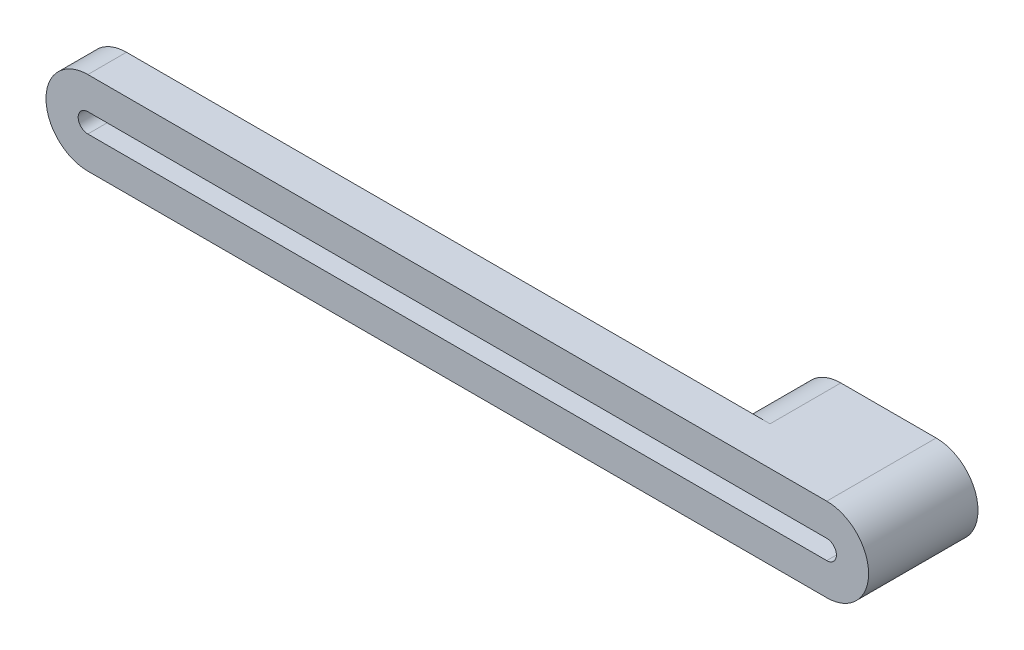
ISO-10303-21;
HEADER;
FILE_DESCRIPTION(('STEP AP214'),'2;1');
FILE_NAME('part.step','',(''),(''),'','','');
FILE_SCHEMA(('AUTOMOTIVE_DESIGN { 1 0 10303 214 1 1 1 1 }'));
ENDSEC;
DATA;
#1=APPLICATION_CONTEXT('core data for automotive mechanical design processes');
#2=APPLICATION_PROTOCOL_DEFINITION('international standard','automotive_design',2000,#1);
#3=PRODUCT_CONTEXT('',#1,'mechanical');
#4=PRODUCT('Part','Part','',(#3));
#5=PRODUCT_RELATED_PRODUCT_CATEGORY('part','',(#4));
#6=PRODUCT_DEFINITION_FORMATION('','',#4);
#7=PRODUCT_DEFINITION_CONTEXT('part definition',#1,'design');
#8=PRODUCT_DEFINITION('design','',#6,#7);
#9=PRODUCT_DEFINITION_SHAPE('','',#8);
#10=(LENGTH_UNIT() NAMED_UNIT(*) SI_UNIT(.MILLI.,.METRE.));
#11=(NAMED_UNIT(*) PLANE_ANGLE_UNIT() SI_UNIT($,.RADIAN.));
#12=(NAMED_UNIT(*) SI_UNIT($,.STERADIAN.) SOLID_ANGLE_UNIT());
#13=UNCERTAINTY_MEASURE_WITH_UNIT(LENGTH_MEASURE(1.E-05),#10,'distance_accuracy_value','');
#14=(GEOMETRIC_REPRESENTATION_CONTEXT(3) GLOBAL_UNCERTAINTY_ASSIGNED_CONTEXT((#13)) GLOBAL_UNIT_ASSIGNED_CONTEXT((#10,
#11,#12)) REPRESENTATION_CONTEXT('',''));
#15=CARTESIAN_POINT('',(0.,0.,0.));
#16=DIRECTION('',(0.,0.,1.));
#17=DIRECTION('',(1.,0.,0.));
#18=AXIS2_PLACEMENT_3D('',#15,#16,#17);
#19=CARTESIAN_POINT('',(-68.8658238926702,16.2918173638099,11.));
#20=DIRECTION('',(0.,0.,-1.));
#21=DIRECTION('',(-1.,0.,0.));
#22=AXIS2_PLACEMENT_3D('',#19,#20,#21);
#23=PLANE('',#22);
#24=CARTESIAN_POINT('',(-83.6756841706861,16.2918173638099,11.));
#25=DIRECTION('',(0.,0.,1.));
#26=DIRECTION('',(1.,0.,0.));
#27=AXIS2_PLACEMENT_3D('',#24,#25,#26);
#28=CIRCLE('',#27,6.5);
#29=CARTESIAN_POINT('',(-90.0002394910229,17.7918173638099,11.));
#30=VERTEX_POINT('',#29);
#31=CARTESIAN_POINT('',(-90.0002394910229,14.7918173638099,11.));
#32=VERTEX_POINT('',#31);
#33=EDGE_CURVE('E226',#30,#32,#28,.T.);
#34=ORIENTED_EDGE('',*,*,#33,.T.);
#35=DIRECTION('',(1.,0.,0.));
#36=VECTOR('',#35,1.);
#37=CARTESIAN_POINT('',(-83.6756841706861,14.7918173638099,11.));
#38=LINE('',#37,#36);
#39=CARTESIAN_POINT('',(-83.6756841706861,14.7918173638099,11.));
#40=VERTEX_POINT('',#39);
#41=EDGE_CURVE('E13',#32,#40,#38,.T.);
#42=ORIENTED_EDGE('',*,*,#41,.T.);
#43=CARTESIAN_POINT('',(-83.6756841706861,16.2918173638099,11.));
#44=DIRECTION('',(0.,0.,1.));
#45=DIRECTION('',(1.,0.,0.));
#46=AXIS2_PLACEMENT_3D('',#43,#44,#45);
#47=CIRCLE('',#46,1.50000000000001);
#48=CARTESIAN_POINT('',(-83.6756841706861,17.7918173638099,11.));
#49=VERTEX_POINT('',#48);
#50=EDGE_CURVE('E201',#49,#40,#47,.T.);
#51=ORIENTED_EDGE('',*,*,#50,.F.);
#52=DIRECTION('',(-1.,0.,0.));
#53=VECTOR('',#52,1.);
#54=CARTESIAN_POINT('',(-183.675684170686,17.7918173638099,11.));
#55=LINE('',#54,#53);
#56=EDGE_CURVE('E55',#49,#30,#55,.T.);
#57=ORIENTED_EDGE('',*,*,#56,.T.);
#58=EDGE_LOOP('',(#34,#42,#51,#57));
#59=FACE_BOUND('',#58,.T.);
#60=ADVANCED_FACE('F46',(#59),#23,.F.);
#61=CARTESIAN_POINT('',(-68.8658238926702,16.2918173638099,0.));
#62=DIRECTION('',(0.,0.,-1.));
#63=DIRECTION('',(-1.,0.,0.));
#64=AXIS2_PLACEMENT_3D('',#61,#62,#63);
#65=PLANE('',#64);
#66=CARTESIAN_POINT('',(-68.8658238926702,16.2918173638099,0.));
#67=DIRECTION('',(0.,0.,1.));
#68=DIRECTION('',(-1.,0.,0.));
#69=AXIS2_PLACEMENT_3D('',#66,#67,#68);
#70=CIRCLE('',#69,6.5);
#71=CARTESIAN_POINT('',(-68.8658238926702,9.79181736380994,0.));
#72=VERTEX_POINT('',#71);
#73=CARTESIAN_POINT('',(-68.8658238926702,22.7918173638099,0.));
#74=VERTEX_POINT('',#73);
#75=EDGE_CURVE('E222',#72,#74,#70,.T.);
#76=ORIENTED_EDGE('',*,*,#75,.F.);
#77=DIRECTION('',(1.,0.,0.));
#78=VECTOR('',#77,1.);
#79=CARTESIAN_POINT('',(-68.8658238926702,9.79181736380994,0.));
#80=LINE('',#79,#78);
#81=CARTESIAN_POINT('',(-83.6756841706861,9.79181736380992,0.));
#82=VERTEX_POINT('',#81);
#83=EDGE_CURVE('E234',#82,#72,#80,.T.);
#84=ORIENTED_EDGE('',*,*,#83,.F.);
#85=CARTESIAN_POINT('',(-83.6756841706861,16.2918173638099,0.));
#86=DIRECTION('',(0.,0.,1.));
#87=DIRECTION('',(1.,0.,0.));
#88=AXIS2_PLACEMENT_3D('',#85,#86,#87);
#89=CIRCLE('',#88,6.5);
#90=CARTESIAN_POINT('',(-83.6756841706861,22.7918173638099,0.));
#91=VERTEX_POINT('',#90);
#92=EDGE_CURVE('E232',#91,#82,#89,.T.);
#93=ORIENTED_EDGE('',*,*,#92,.F.);
#94=DIRECTION('',(-1.,0.,0.));
#95=VECTOR('',#94,1.);
#96=CARTESIAN_POINT('',(-68.8658238926702,22.7918173638099,0.));
#97=LINE('',#96,#95);
#98=EDGE_CURVE('E230',#74,#91,#97,.T.);
#99=ORIENTED_EDGE('',*,*,#98,.F.);
#100=EDGE_LOOP('',(#76,#84,#93,#99));
#101=FACE_BOUND('',#100,.T.);
#102=DIRECTION('',(1.,0.,0.));
#103=VECTOR('',#102,1.);
#104=CARTESIAN_POINT('',(-68.8658238926702,14.7918173638099,0.));
#105=LINE('',#104,#103);
#106=CARTESIAN_POINT('',(-83.6756841706861,14.7918173638099,0.));
#107=VERTEX_POINT('',#106);
#108=CARTESIAN_POINT('',(-68.8658238926702,14.7918173638099,0.));
#109=VERTEX_POINT('',#108);
#110=EDGE_CURVE('E205',#107,#109,#105,.T.);
#111=ORIENTED_EDGE('',*,*,#110,.T.);
#112=CARTESIAN_POINT('',(-68.8658238926702,16.2918173638099,0.));
#113=DIRECTION('',(0.,0.,1.));
#114=DIRECTION('',(-1.,0.,0.));
#115=AXIS2_PLACEMENT_3D('',#112,#113,#114);
#116=CIRCLE('',#115,1.5);
#117=CARTESIAN_POINT('',(-68.8658238926702,17.7918173638099,0.));
#118=VERTEX_POINT('',#117);
#119=EDGE_CURVE('E72',#109,#118,#116,.T.);
#120=ORIENTED_EDGE('',*,*,#119,.T.);
#121=DIRECTION('',(-1.,0.,0.));
#122=VECTOR('',#121,1.);
#123=CARTESIAN_POINT('',(-68.8658238926702,17.7918173638099,0.));
#124=LINE('',#123,#122);
#125=CARTESIAN_POINT('',(-83.6756841706861,17.7918173638099,0.));
#126=VERTEX_POINT('',#125);
#127=EDGE_CURVE('E207',#118,#126,#124,.T.);
#128=ORIENTED_EDGE('',*,*,#127,.T.);
#129=CARTESIAN_POINT('',(-83.6756841706861,16.2918173638099,0.));
#130=DIRECTION('',(0.,0.,1.));
#131=DIRECTION('',(1.,0.,0.));
#132=AXIS2_PLACEMENT_3D('',#129,#130,#131);
#133=CIRCLE('',#132,1.50000000000001);
#134=EDGE_CURVE('E210',#126,#107,#133,.T.);
#135=ORIENTED_EDGE('',*,*,#134,.T.);
#136=EDGE_LOOP('',(#111,#120,#128,#135));
#137=FACE_BOUND('',#136,.T.);
#138=ADVANCED_FACE('F267',(#101,#137),#65,.T.);
#139=CARTESIAN_POINT('',(-68.8658238926702,16.2918173638099,11.));
#140=DIRECTION('',(0.,0.,-1.));
#141=DIRECTION('',(-1.,0.,0.));
#142=AXIS2_PLACEMENT_3D('',#139,#140,#141);
#143=CYLINDRICAL_SURFACE('',#142,6.5);
#144=ORIENTED_EDGE('',*,*,#75,.T.);
#145=DIRECTION('',(0.,0.,-1.));
#146=VECTOR('',#145,1.);
#147=CARTESIAN_POINT('',(-68.8658238926702,22.7918173638099,11.));
#148=LINE('',#147,#146);
#149=CARTESIAN_POINT('',(-68.8658238926702,22.7918173638099,17.));
#150=VERTEX_POINT('',#149);
#151=EDGE_CURVE('E50',#150,#74,#148,.T.);
#152=ORIENTED_EDGE('',*,*,#151,.F.);
#153=CARTESIAN_POINT('',(-68.8658238926702,16.2918173638099,17.));
#154=DIRECTION('',(0.,0.,1.));
#155=DIRECTION('',(-1.,0.,0.));
#156=AXIS2_PLACEMENT_3D('',#153,#154,#155);
#157=CIRCLE('',#156,6.5);
#158=CARTESIAN_POINT('',(-68.8658238926701,9.79181736380994,17.));
#159=VERTEX_POINT('',#158);
#160=EDGE_CURVE('E184',#159,#150,#157,.T.);
#161=ORIENTED_EDGE('',*,*,#160,.F.);
#162=DIRECTION('',(0.,0.,-1.));
#163=VECTOR('',#162,1.);
#164=CARTESIAN_POINT('',(-68.8658238926702,9.79181736380994,11.));
#165=LINE('',#164,#163);
#166=EDGE_CURVE('E225',#159,#72,#165,.T.);
#167=ORIENTED_EDGE('',*,*,#166,.T.);
#168=EDGE_LOOP('',(#144,#152,#161,#167));
#169=FACE_BOUND('',#168,.T.);
#170=ADVANCED_FACE('F48',(#169),#143,.T.);
#171=CARTESIAN_POINT('',(-68.8658238926702,22.7918173638099,11.));
#172=DIRECTION('',(0.,-1.,0.));
#173=DIRECTION('',(0.,0.,-1.));
#174=AXIS2_PLACEMENT_3D('',#171,#172,#173);
#175=PLANE('',#174);
#176=ORIENTED_EDGE('',*,*,#98,.T.);
#177=DIRECTION('',(0.,0.,-1.));
#178=VECTOR('',#177,1.);
#179=CARTESIAN_POINT('',(-83.6756841706861,22.7918173638099,11.));
#180=LINE('',#179,#178);
#181=CARTESIAN_POINT('',(-83.6756841706861,22.7918173638099,11.));
#182=VERTEX_POINT('',#181);
#183=EDGE_CURVE('E240',#182,#91,#180,.T.);
#184=ORIENTED_EDGE('',*,*,#183,.F.);
#185=DIRECTION('',(-1.,0.,0.));
#186=VECTOR('',#185,1.);
#187=CARTESIAN_POINT('',(-183.675684170686,22.7918173638099,11.));
#188=LINE('',#187,#186);
#189=CARTESIAN_POINT('',(-183.675684170686,22.7918173638099,11.));
#190=VERTEX_POINT('',#189);
#191=EDGE_CURVE('E181',#182,#190,#188,.T.);
#192=ORIENTED_EDGE('',*,*,#191,.T.);
#193=DIRECTION('',(0.,0.,-1.));
#194=VECTOR('',#193,1.);
#195=CARTESIAN_POINT('',(-183.675684170686,22.7918173638099,17.));
#196=LINE('',#195,#194);
#197=CARTESIAN_POINT('',(-183.675684170686,22.7918173638099,17.));
#198=VERTEX_POINT('',#197);
#199=EDGE_CURVE('E189',#198,#190,#196,.T.);
#200=ORIENTED_EDGE('',*,*,#199,.F.);
#201=DIRECTION('',(-1.,0.,0.));
#202=VECTOR('',#201,1.);
#203=CARTESIAN_POINT('',(-83.6756841706861,22.7918173638099,17.));
#204=LINE('',#203,#202);
#205=EDGE_CURVE('E187',#150,#198,#204,.T.);
#206=ORIENTED_EDGE('',*,*,#205,.F.);
#207=ORIENTED_EDGE('',*,*,#151,.T.);
#208=EDGE_LOOP('',(#176,#184,#192,#200,#206,#207));
#209=FACE_BOUND('',#208,.T.);
#210=ADVANCED_FACE('F273',(#209),#175,.F.);
#211=CARTESIAN_POINT('',(-83.6756841706861,16.2918173638099,11.));
#212=DIRECTION('',(0.,0.,-1.));
#213=DIRECTION('',(-1.,0.,0.));
#214=AXIS2_PLACEMENT_3D('',#211,#212,#213);
#215=CYLINDRICAL_SURFACE('',#214,6.5);
#216=ORIENTED_EDGE('',*,*,#92,.T.);
#217=DIRECTION('',(0.,0.,-1.));
#218=VECTOR('',#217,1.);
#219=CARTESIAN_POINT('',(-83.6756841706861,9.79181736380992,11.));
#220=LINE('',#219,#218);
#221=CARTESIAN_POINT('',(-83.6756841706861,9.79181736380993,11.));
#222=VERTEX_POINT('',#221);
#223=EDGE_CURVE('E238',#222,#82,#220,.T.);
#224=ORIENTED_EDGE('',*,*,#223,.F.);
#225=EDGE_CURVE('E227',#32,#222,#28,.T.);
#226=ORIENTED_EDGE('',*,*,#225,.F.);
#227=ORIENTED_EDGE('',*,*,#33,.F.);
#228=EDGE_CURVE('E223',#182,#30,#28,.T.);
#229=ORIENTED_EDGE('',*,*,#228,.F.);
#230=ORIENTED_EDGE('',*,*,#183,.T.);
#231=EDGE_LOOP('',(#216,#224,#226,#227,#229,#230));
#232=FACE_BOUND('',#231,.T.);
#233=ADVANCED_FACE('F256',(#232),#215,.T.);
#234=CARTESIAN_POINT('',(-68.8658238926702,9.79181736380994,11.));
#235=DIRECTION('',(0.,1.,0.));
#236=DIRECTION('',(-1.,0.,0.));
#237=AXIS2_PLACEMENT_3D('',#234,#235,#236);
#238=PLANE('',#237);
#239=ORIENTED_EDGE('',*,*,#83,.T.);
#240=ORIENTED_EDGE('',*,*,#166,.F.);
#241=DIRECTION('',(1.,0.,0.));
#242=VECTOR('',#241,1.);
#243=CARTESIAN_POINT('',(-183.675684170686,9.79181736380991,17.));
#244=LINE('',#243,#242);
#245=CARTESIAN_POINT('',(-183.675684170686,9.79181736380991,17.));
#246=VERTEX_POINT('',#245);
#247=EDGE_CURVE('E180',#246,#159,#244,.T.);
#248=ORIENTED_EDGE('',*,*,#247,.F.);
#249=DIRECTION('',(0.,0.,-1.));
#250=VECTOR('',#249,1.);
#251=CARTESIAN_POINT('',(-183.675684170686,9.79181736380991,17.));
#252=LINE('',#251,#250);
#253=CARTESIAN_POINT('',(-183.675684170686,9.79181736380991,11.));
#254=VERTEX_POINT('',#253);
#255=EDGE_CURVE('E198',#246,#254,#252,.T.);
#256=ORIENTED_EDGE('',*,*,#255,.T.);
#257=DIRECTION('',(1.,0.,0.));
#258=VECTOR('',#257,1.);
#259=CARTESIAN_POINT('',(-83.6756841706861,9.79181736380992,11.));
#260=LINE('',#259,#258);
#261=EDGE_CURVE('E192',#254,#222,#260,.T.);
#262=ORIENTED_EDGE('',*,*,#261,.T.);
#263=ORIENTED_EDGE('',*,*,#223,.T.);
#264=EDGE_LOOP('',(#239,#240,#248,#256,#262,#263));
#265=FACE_BOUND('',#264,.T.);
#266=ADVANCED_FACE('F262',(#265),#238,.F.);
#267=CARTESIAN_POINT('',(-68.8658238926702,16.2918173638099,11.));
#268=DIRECTION('',(0.,0.,-1.));
#269=DIRECTION('',(-1.,0.,0.));
#270=AXIS2_PLACEMENT_3D('',#267,#268,#269);
#271=CYLINDRICAL_SURFACE('',#270,1.5);
#272=ORIENTED_EDGE('',*,*,#119,.F.);
#273=DIRECTION('',(0.,0.,-1.));
#274=VECTOR('',#273,1.);
#275=CARTESIAN_POINT('',(-68.8658238926702,14.7918173638099,11.));
#276=LINE('',#275,#274);
#277=CARTESIAN_POINT('',(-68.8658238926702,14.7918173638099,17.));
#278=VERTEX_POINT('',#277);
#279=EDGE_CURVE('E204',#278,#109,#276,.T.);
#280=ORIENTED_EDGE('',*,*,#279,.F.);
#281=CARTESIAN_POINT('',(-68.8658238926702,16.2918173638099,17.));
#282=DIRECTION('',(0.,0.,1.));
#283=DIRECTION('',(-1.,0.,0.));
#284=AXIS2_PLACEMENT_3D('',#281,#282,#283);
#285=CIRCLE('',#284,1.49999999999998);
#286=CARTESIAN_POINT('',(-68.8658238926702,17.7918173638099,17.));
#287=VERTEX_POINT('',#286);
#288=EDGE_CURVE('E167',#278,#287,#285,.T.);
#289=ORIENTED_EDGE('',*,*,#288,.T.);
#290=DIRECTION('',(0.,0.,-1.));
#291=VECTOR('',#290,1.);
#292=CARTESIAN_POINT('',(-68.8658238926702,17.7918173638099,11.));
#293=LINE('',#292,#291);
#294=EDGE_CURVE('E220',#287,#118,#293,.T.);
#295=ORIENTED_EDGE('',*,*,#294,.T.);
#296=EDGE_LOOP('',(#272,#280,#289,#295));
#297=FACE_BOUND('',#296,.T.);
#298=ADVANCED_FACE('F278',(#297),#271,.F.);
#299=CARTESIAN_POINT('',(-68.8658238926702,17.7918173638099,11.));
#300=DIRECTION('',(0.,-1.,0.));
#301=DIRECTION('',(0.,0.,-1.));
#302=AXIS2_PLACEMENT_3D('',#299,#300,#301);
#303=PLANE('',#302);
#304=ORIENTED_EDGE('',*,*,#127,.F.);
#305=ORIENTED_EDGE('',*,*,#294,.F.);
#306=DIRECTION('',(-1.,0.,0.));
#307=VECTOR('',#306,1.);
#308=CARTESIAN_POINT('',(-83.6756841706861,17.7918173638099,17.));
#309=LINE('',#308,#307);
#310=CARTESIAN_POINT('',(-183.675684170686,17.7918173638099,17.));
#311=VERTEX_POINT('',#310);
#312=EDGE_CURVE('E169',#287,#311,#309,.T.);
#313=ORIENTED_EDGE('',*,*,#312,.T.);
#314=DIRECTION('',(0.,0.,-1.));
#315=VECTOR('',#314,1.);
#316=CARTESIAN_POINT('',(-183.675684170686,17.7918173638099,17.));
#317=LINE('',#316,#315);
#318=CARTESIAN_POINT('',(-183.675684170686,17.7918173638099,11.));
#319=VERTEX_POINT('',#318);
#320=EDGE_CURVE('E151',#311,#319,#317,.T.);
#321=ORIENTED_EDGE('',*,*,#320,.T.);
#322=EDGE_CURVE('E64',#30,#319,#55,.T.);
#323=ORIENTED_EDGE('',*,*,#322,.F.);
#324=ORIENTED_EDGE('',*,*,#56,.F.);
#325=DIRECTION('',(0.,0.,-1.));
#326=VECTOR('',#325,1.);
#327=CARTESIAN_POINT('',(-83.6756841706861,17.7918173638099,11.));
#328=LINE('',#327,#326);
#329=EDGE_CURVE('E218',#49,#126,#328,.T.);
#330=ORIENTED_EDGE('',*,*,#329,.T.);
#331=EDGE_LOOP('',(#304,#305,#313,#321,#323,#324,#330));
#332=FACE_BOUND('',#331,.T.);
#333=ADVANCED_FACE('F277',(#332),#303,.T.);
#334=CARTESIAN_POINT('',(-83.6756841706861,16.2918173638099,11.));
#335=DIRECTION('',(0.,0.,-1.));
#336=DIRECTION('',(-1.,0.,0.));
#337=AXIS2_PLACEMENT_3D('',#334,#335,#336);
#338=CYLINDRICAL_SURFACE('',#337,1.50000000000001);
#339=ORIENTED_EDGE('',*,*,#134,.F.);
#340=ORIENTED_EDGE('',*,*,#329,.F.);
#341=ORIENTED_EDGE('',*,*,#50,.T.);
#342=DIRECTION('',(0.,0.,-1.));
#343=VECTOR('',#342,1.);
#344=CARTESIAN_POINT('',(-83.6756841706861,14.7918173638099,11.));
#345=LINE('',#344,#343);
#346=EDGE_CURVE('E216',#40,#107,#345,.T.);
#347=ORIENTED_EDGE('',*,*,#346,.T.);
#348=EDGE_LOOP('',(#339,#340,#341,#347));
#349=FACE_BOUND('',#348,.T.);
#350=ADVANCED_FACE('F282',(#349),#338,.F.);
#351=CARTESIAN_POINT('',(-68.8658238926702,14.7918173638099,11.));
#352=DIRECTION('',(0.,1.,0.));
#353=DIRECTION('',(-1.,0.,0.));
#354=AXIS2_PLACEMENT_3D('',#351,#352,#353);
#355=PLANE('',#354);
#356=ORIENTED_EDGE('',*,*,#110,.F.);
#357=ORIENTED_EDGE('',*,*,#346,.F.);
#358=ORIENTED_EDGE('',*,*,#41,.F.);
#359=CARTESIAN_POINT('',(-183.675684170686,14.7918173638099,11.));
#360=VERTEX_POINT('',#359);
#361=EDGE_CURVE('E57',#360,#32,#38,.T.);
#362=ORIENTED_EDGE('',*,*,#361,.F.);
#363=DIRECTION('',(0.,0.,-1.));
#364=VECTOR('',#363,1.);
#365=CARTESIAN_POINT('',(-183.675684170686,14.7918173638099,17.));
#366=LINE('',#365,#364);
#367=CARTESIAN_POINT('',(-183.675684170686,14.7918173638099,17.));
#368=VERTEX_POINT('',#367);
#369=EDGE_CURVE('E149',#368,#360,#366,.T.);
#370=ORIENTED_EDGE('',*,*,#369,.F.);
#371=DIRECTION('',(1.,0.,0.));
#372=VECTOR('',#371,1.);
#373=CARTESIAN_POINT('',(-183.675684170686,14.7918173638099,17.));
#374=LINE('',#373,#372);
#375=EDGE_CURVE('E155',#368,#278,#374,.T.);
#376=ORIENTED_EDGE('',*,*,#375,.T.);
#377=ORIENTED_EDGE('',*,*,#279,.T.);
#378=EDGE_LOOP('',(#356,#357,#358,#362,#370,#376,#377));
#379=FACE_BOUND('',#378,.T.);
#380=ADVANCED_FACE('F160',(#379),#355,.T.);
#381=CARTESIAN_POINT('',(-183.675684170686,16.2918173638099,11.));
#382=DIRECTION('',(0.,0.,1.));
#383=DIRECTION('',(1.,0.,0.));
#384=AXIS2_PLACEMENT_3D('',#381,#382,#383);
#385=PLANE('',#384);
#386=ORIENTED_EDGE('',*,*,#191,.F.);
#387=ORIENTED_EDGE('',*,*,#228,.T.);
#388=ORIENTED_EDGE('',*,*,#322,.T.);
#389=CARTESIAN_POINT('',(-183.675684170686,16.2918173638099,11.));
#390=DIRECTION('',(0.,0.,1.));
#391=DIRECTION('',(1.,0.,0.));
#392=AXIS2_PLACEMENT_3D('',#389,#390,#391);
#393=CIRCLE('',#392,1.5);
#394=EDGE_CURVE('E173',#319,#360,#393,.T.);
#395=ORIENTED_EDGE('',*,*,#394,.T.);
#396=ORIENTED_EDGE('',*,*,#361,.T.);
#397=ORIENTED_EDGE('',*,*,#225,.T.);
#398=ORIENTED_EDGE('',*,*,#261,.F.);
#399=CARTESIAN_POINT('',(-183.675684170686,16.2918173638099,11.));
#400=DIRECTION('',(0.,0.,1.));
#401=DIRECTION('',(1.,0.,0.));
#402=AXIS2_PLACEMENT_3D('',#399,#400,#401);
#403=CIRCLE('',#402,6.5);
#404=EDGE_CURVE('E163',#190,#254,#403,.T.);
#405=ORIENTED_EDGE('',*,*,#404,.F.);
#406=EDGE_LOOP('',(#386,#387,#388,#395,#396,#397,#398,#405));
#407=FACE_BOUND('',#406,.T.);
#408=ADVANCED_FACE('F259',(#407),#385,.F.);
#409=CARTESIAN_POINT('',(-183.675684170686,16.2918173638099,17.));
#410=DIRECTION('',(0.,0.,1.));
#411=DIRECTION('',(1.,0.,0.));
#412=AXIS2_PLACEMENT_3D('',#409,#410,#411);
#413=PLANE('',#412);
#414=CARTESIAN_POINT('',(-183.675684170686,16.2918173638099,17.));
#415=DIRECTION('',(0.,0.,1.));
#416=DIRECTION('',(1.,0.,0.));
#417=AXIS2_PLACEMENT_3D('',#414,#415,#416);
#418=CIRCLE('',#417,6.5);
#419=EDGE_CURVE('E177',#198,#246,#418,.T.);
#420=ORIENTED_EDGE('',*,*,#419,.T.);
#421=ORIENTED_EDGE('',*,*,#247,.T.);
#422=ORIENTED_EDGE('',*,*,#160,.T.);
#423=ORIENTED_EDGE('',*,*,#205,.T.);
#424=EDGE_LOOP('',(#420,#421,#422,#423));
#425=FACE_BOUND('',#424,.T.);
#426=ORIENTED_EDGE('',*,*,#375,.F.);
#427=CARTESIAN_POINT('',(-183.675684170686,16.2918173638099,17.));
#428=DIRECTION('',(0.,0.,1.));
#429=DIRECTION('',(1.,0.,0.));
#430=AXIS2_PLACEMENT_3D('',#427,#428,#429);
#431=CIRCLE('',#430,1.5);
#432=EDGE_CURVE('E145',#311,#368,#431,.T.);
#433=ORIENTED_EDGE('',*,*,#432,.F.);
#434=ORIENTED_EDGE('',*,*,#312,.F.);
#435=ORIENTED_EDGE('',*,*,#288,.F.);
#436=EDGE_LOOP('',(#426,#433,#434,#435));
#437=FACE_BOUND('',#436,.T.);
#438=ADVANCED_FACE('F165',(#425,#437),#413,.T.);
#439=CARTESIAN_POINT('',(-183.675684170686,16.2918173638099,17.));
#440=DIRECTION('',(0.,0.,-1.));
#441=DIRECTION('',(-1.,0.,0.));
#442=AXIS2_PLACEMENT_3D('',#439,#440,#441);
#443=CYLINDRICAL_SURFACE('',#442,6.5);
#444=ORIENTED_EDGE('',*,*,#404,.T.);
#445=ORIENTED_EDGE('',*,*,#255,.F.);
#446=ORIENTED_EDGE('',*,*,#419,.F.);
#447=ORIENTED_EDGE('',*,*,#199,.T.);
#448=EDGE_LOOP('',(#444,#445,#446,#447));
#449=FACE_BOUND('',#448,.T.);
#450=ADVANCED_FACE('F276',(#449),#443,.T.);
#451=CARTESIAN_POINT('',(-183.675684170686,16.2918173638099,17.));
#452=DIRECTION('',(0.,0.,-1.));
#453=DIRECTION('',(-1.,0.,0.));
#454=AXIS2_PLACEMENT_3D('',#451,#452,#453);
#455=CYLINDRICAL_SURFACE('',#454,1.5);
#456=ORIENTED_EDGE('',*,*,#394,.F.);
#457=ORIENTED_EDGE('',*,*,#320,.F.);
#458=ORIENTED_EDGE('',*,*,#432,.T.);
#459=ORIENTED_EDGE('',*,*,#369,.T.);
#460=EDGE_LOOP('',(#456,#457,#458,#459));
#461=FACE_BOUND('',#460,.T.);
#462=ADVANCED_FACE('F148',(#461),#455,.F.);
#463=CLOSED_SHELL('',(#60,#138,#170,#210,#233,#266,#298,#333,#350,#380,#408,#438,#450,#462));
#464=MANIFOLD_SOLID_BREP('B2',#463);
#465=ADVANCED_BREP_SHAPE_REPRESENTATION('',(#18,#464),#14);
#466=SHAPE_DEFINITION_REPRESENTATION(#9,#465);
ENDSEC;
END-ISO-10303-21;
